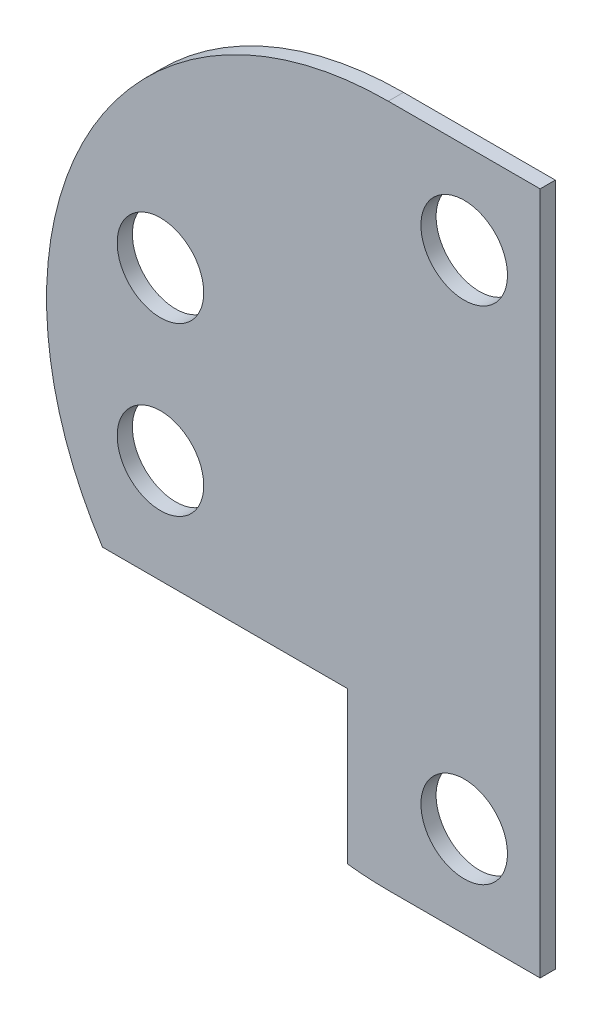
ISO-10303-21;
HEADER;
FILE_DESCRIPTION(('STEP AP214'),'2;1');
FILE_NAME('part.step','',(''),(''),'','','');
FILE_SCHEMA(('AUTOMOTIVE_DESIGN { 1 0 10303 214 1 1 1 1 }'));
ENDSEC;
DATA;
#1=APPLICATION_CONTEXT('core data for automotive mechanical design processes');
#2=APPLICATION_PROTOCOL_DEFINITION('international standard','automotive_design',2000,#1);
#3=PRODUCT_CONTEXT('',#1,'mechanical');
#4=PRODUCT('Part','Part','',(#3));
#5=PRODUCT_RELATED_PRODUCT_CATEGORY('part','',(#4));
#6=PRODUCT_DEFINITION_FORMATION('','',#4);
#7=PRODUCT_DEFINITION_CONTEXT('part definition',#1,'design');
#8=PRODUCT_DEFINITION('design','',#6,#7);
#9=PRODUCT_DEFINITION_SHAPE('','',#8);
#10=(LENGTH_UNIT() NAMED_UNIT(*) SI_UNIT(.MILLI.,.METRE.));
#11=(NAMED_UNIT(*) PLANE_ANGLE_UNIT() SI_UNIT($,.RADIAN.));
#12=(NAMED_UNIT(*) SI_UNIT($,.STERADIAN.) SOLID_ANGLE_UNIT());
#13=UNCERTAINTY_MEASURE_WITH_UNIT(LENGTH_MEASURE(1.E-05),#10,'distance_accuracy_value','');
#14=(GEOMETRIC_REPRESENTATION_CONTEXT(3) GLOBAL_UNCERTAINTY_ASSIGNED_CONTEXT((#13)) GLOBAL_UNIT_ASSIGNED_CONTEXT((#10,
#11,#12)) REPRESENTATION_CONTEXT('',''));
#15=CARTESIAN_POINT('',(0.,0.,0.));
#16=DIRECTION('',(0.,0.,1.));
#17=DIRECTION('',(1.,0.,0.));
#18=AXIS2_PLACEMENT_3D('',#15,#16,#17);
#19=CARTESIAN_POINT('',(-5.,0.,1.));
#20=DIRECTION('',(0.,0.,-1.));
#21=DIRECTION('',(-1.,0.,0.));
#22=AXIS2_PLACEMENT_3D('',#19,#20,#21);
#23=CYLINDRICAL_SURFACE('',#22,22.5);
#24=DIRECTION('',(0.,0.,-1.));
#25=VECTOR('',#24,1.);
#26=CARTESIAN_POINT('',(-23.8142073976025,-12.34,1.));
#27=LINE('',#26,#25);
#28=CARTESIAN_POINT('',(-23.8142073976025,-12.34,1.));
#29=VERTEX_POINT('',#28);
#30=CARTESIAN_POINT('',(-23.8142073976025,-12.34,0.));
#31=VERTEX_POINT('',#30);
#32=EDGE_CURVE('E113',#29,#31,#27,.T.);
#33=ORIENTED_EDGE('',*,*,#32,.F.);
#34=CARTESIAN_POINT('',(-5.,0.,1.));
#35=DIRECTION('',(0.,0.,1.));
#36=DIRECTION('',(-1.,0.,0.));
#37=AXIS2_PLACEMENT_3D('',#34,#35,#36);
#38=CIRCLE('',#37,22.5);
#39=CARTESIAN_POINT('',(-5.,22.5,1.));
#40=VERTEX_POINT('',#39);
#41=EDGE_CURVE('E124',#40,#29,#38,.T.);
#42=ORIENTED_EDGE('',*,*,#41,.F.);
#43=DIRECTION('',(0.,0.,-1.));
#44=VECTOR('',#43,1.);
#45=CARTESIAN_POINT('',(-5.,22.5,1.));
#46=LINE('',#45,#44);
#47=CARTESIAN_POINT('',(-5.,22.5,0.));
#48=VERTEX_POINT('',#47);
#49=EDGE_CURVE('E44',#40,#48,#46,.T.);
#50=ORIENTED_EDGE('',*,*,#49,.T.);
#51=CARTESIAN_POINT('',(-5.,0.,0.));
#52=DIRECTION('',(0.,0.,1.));
#53=DIRECTION('',(-1.,0.,0.));
#54=AXIS2_PLACEMENT_3D('',#51,#52,#53);
#55=CIRCLE('',#54,22.5);
#56=EDGE_CURVE('E139',#48,#31,#55,.T.);
#57=ORIENTED_EDGE('',*,*,#56,.T.);
#58=EDGE_LOOP('',(#33,#42,#50,#57));
#59=FACE_BOUND('',#58,.T.);
#60=ADVANCED_FACE('F36',(#59),#23,.T.);
#61=CARTESIAN_POINT('',(-5.,0.,1.));
#62=DIRECTION('',(0.,0.,-1.));
#63=DIRECTION('',(-1.,0.,0.));
#64=AXIS2_PLACEMENT_3D('',#61,#62,#63);
#65=PLANE('',#64);
#66=DIRECTION('',(-1.,0.,0.));
#67=VECTOR('',#66,1.);
#68=CARTESIAN_POINT('',(-7.7,-12.34,1.));
#69=LINE('',#68,#67);
#70=CARTESIAN_POINT('',(-7.7,-12.34,1.));
#71=VERTEX_POINT('',#70);
#72=EDGE_CURVE('E51',#71,#29,#69,.T.);
#73=ORIENTED_EDGE('',*,*,#72,.F.);
#74=DIRECTION('',(0.,-1.,0.));
#75=VECTOR('',#74,1.);
#76=CARTESIAN_POINT('',(-7.7,-12.34,1.));
#77=LINE('',#76,#75);
#78=CARTESIAN_POINT('',(-7.69999999999999,-22.3374125627835,1.));
#79=VERTEX_POINT('',#78);
#80=EDGE_CURVE('E107',#71,#79,#77,.T.);
#81=ORIENTED_EDGE('',*,*,#80,.T.);
#82=CARTESIAN_POINT('',(-5.,-22.5,1.));
#83=VERTEX_POINT('',#82);
#84=EDGE_CURVE('E117',#79,#83,#38,.T.);
#85=ORIENTED_EDGE('',*,*,#84,.T.);
#86=DIRECTION('',(1.,0.,0.));
#87=VECTOR('',#86,1.);
#88=CARTESIAN_POINT('',(-5.,-22.5,1.));
#89=LINE('',#88,#87);
#90=CARTESIAN_POINT('',(5.,-22.5,1.));
#91=VERTEX_POINT('',#90);
#92=EDGE_CURVE('E60',#83,#91,#89,.T.);
#93=ORIENTED_EDGE('',*,*,#92,.T.);
#94=DIRECTION('',(0.,1.,0.));
#95=VECTOR('',#94,1.);
#96=CARTESIAN_POINT('',(5.,-22.5,1.));
#97=LINE('',#96,#95);
#98=CARTESIAN_POINT('',(5.,22.5,1.));
#99=VERTEX_POINT('',#98);
#100=EDGE_CURVE('E126',#91,#99,#97,.T.);
#101=ORIENTED_EDGE('',*,*,#100,.T.);
#102=DIRECTION('',(-1.,0.,0.));
#103=VECTOR('',#102,1.);
#104=CARTESIAN_POINT('',(-5.,22.5,1.));
#105=LINE('',#104,#103);
#106=EDGE_CURVE('E88',#99,#40,#105,.T.);
#107=ORIENTED_EDGE('',*,*,#106,.T.);
#108=ORIENTED_EDGE('',*,*,#41,.T.);
#109=EDGE_LOOP('',(#73,#81,#85,#93,#101,#107,#108));
#110=FACE_BOUND('',#109,.T.);
#111=CARTESIAN_POINT('',(0.,16.5,1.));
#112=DIRECTION('',(0.,0.,1.));
#113=DIRECTION('',(1.,0.,0.));
#114=AXIS2_PLACEMENT_3D('',#111,#112,#113);
#115=CIRCLE('',#114,2.85);
#116=CARTESIAN_POINT('',(2.85,16.5,1.));
#117=VERTEX_POINT('',#116);
#118=EDGE_CURVE('E136',#117,#117,#115,.T.);
#119=ORIENTED_EDGE('',*,*,#118,.F.);
#120=EDGE_LOOP('',(#119));
#121=FACE_BOUND('',#120,.T.);
#122=CARTESIAN_POINT('',(0.,-16.5,1.));
#123=DIRECTION('',(0.,0.,1.));
#124=DIRECTION('',(1.,0.,0.));
#125=AXIS2_PLACEMENT_3D('',#122,#123,#124);
#126=CIRCLE('',#125,2.85);
#127=CARTESIAN_POINT('',(2.85,-16.5,1.));
#128=VERTEX_POINT('',#127);
#129=EDGE_CURVE('E174',#128,#128,#126,.T.);
#130=ORIENTED_EDGE('',*,*,#129,.F.);
#131=EDGE_LOOP('',(#130));
#132=FACE_BOUND('',#131,.T.);
#133=CARTESIAN_POINT('',(-20.,-5.5,1.));
#134=DIRECTION('',(0.,0.,1.));
#135=DIRECTION('',(1.,0.,0.));
#136=AXIS2_PLACEMENT_3D('',#133,#134,#135);
#137=CIRCLE('',#136,2.85);
#138=CARTESIAN_POINT('',(-17.15,-5.5,1.));
#139=VERTEX_POINT('',#138);
#140=EDGE_CURVE('E168',#139,#139,#137,.T.);
#141=ORIENTED_EDGE('',*,*,#140,.F.);
#142=EDGE_LOOP('',(#141));
#143=FACE_BOUND('',#142,.T.);
#144=CARTESIAN_POINT('',(-20.,5.5,1.));
#145=DIRECTION('',(0.,0.,1.));
#146=DIRECTION('',(1.,0.,0.));
#147=AXIS2_PLACEMENT_3D('',#144,#145,#146);
#148=CIRCLE('',#147,2.85);
#149=CARTESIAN_POINT('',(-17.15,5.5,1.));
#150=VERTEX_POINT('',#149);
#151=EDGE_CURVE('E162',#150,#150,#148,.T.);
#152=ORIENTED_EDGE('',*,*,#151,.F.);
#153=EDGE_LOOP('',(#152));
#154=FACE_BOUND('',#153,.T.);
#155=ADVANCED_FACE('F115',(#110,#121,#132,#143,#154),#65,.F.);
#156=CARTESIAN_POINT('',(-5.,0.,0.));
#157=DIRECTION('',(0.,0.,-1.));
#158=DIRECTION('',(-1.,0.,0.));
#159=AXIS2_PLACEMENT_3D('',#156,#157,#158);
#160=PLANE('',#159);
#161=DIRECTION('',(0.,-1.,0.));
#162=VECTOR('',#161,1.);
#163=CARTESIAN_POINT('',(-7.7,-12.34,0.));
#164=LINE('',#163,#162);
#165=CARTESIAN_POINT('',(-7.7,-12.34,0.));
#166=VERTEX_POINT('',#165);
#167=CARTESIAN_POINT('',(-7.69999999999999,-22.3374125627835,0.));
#168=VERTEX_POINT('',#167);
#169=EDGE_CURVE('E109',#166,#168,#164,.T.);
#170=ORIENTED_EDGE('',*,*,#169,.F.);
#171=DIRECTION('',(-1.,0.,0.));
#172=VECTOR('',#171,1.);
#173=CARTESIAN_POINT('',(-7.7,-12.34,0.));
#174=LINE('',#173,#172);
#175=EDGE_CURVE('E120',#166,#31,#174,.T.);
#176=ORIENTED_EDGE('',*,*,#175,.T.);
#177=ORIENTED_EDGE('',*,*,#56,.F.);
#178=DIRECTION('',(-1.,0.,0.));
#179=VECTOR('',#178,1.);
#180=CARTESIAN_POINT('',(-5.,22.5,0.));
#181=LINE('',#180,#179);
#182=CARTESIAN_POINT('',(5.,22.5,0.));
#183=VERTEX_POINT('',#182);
#184=EDGE_CURVE('E135',#183,#48,#181,.T.);
#185=ORIENTED_EDGE('',*,*,#184,.F.);
#186=DIRECTION('',(0.,1.,0.));
#187=VECTOR('',#186,1.);
#188=CARTESIAN_POINT('',(5.,-22.5,0.));
#189=LINE('',#188,#187);
#190=CARTESIAN_POINT('',(5.,-22.5,0.));
#191=VERTEX_POINT('',#190);
#192=EDGE_CURVE('E132',#191,#183,#189,.T.);
#193=ORIENTED_EDGE('',*,*,#192,.F.);
#194=DIRECTION('',(1.,0.,0.));
#195=VECTOR('',#194,1.);
#196=CARTESIAN_POINT('',(-5.,-22.5,0.));
#197=LINE('',#196,#195);
#198=CARTESIAN_POINT('',(-5.,-22.5,0.));
#199=VERTEX_POINT('',#198);
#200=EDGE_CURVE('E81',#199,#191,#197,.T.);
#201=ORIENTED_EDGE('',*,*,#200,.F.);
#202=EDGE_CURVE('E138',#168,#199,#55,.T.);
#203=ORIENTED_EDGE('',*,*,#202,.F.);
#204=EDGE_LOOP('',(#170,#176,#177,#185,#193,#201,#203));
#205=FACE_BOUND('',#204,.T.);
#206=CARTESIAN_POINT('',(-20.,-5.5,0.));
#207=DIRECTION('',(0.,0.,1.));
#208=DIRECTION('',(1.,0.,0.));
#209=AXIS2_PLACEMENT_3D('',#206,#207,#208);
#210=CIRCLE('',#209,2.85);
#211=CARTESIAN_POINT('',(-17.15,-5.5,0.));
#212=VERTEX_POINT('',#211);
#213=EDGE_CURVE('E165',#212,#212,#210,.T.);
#214=ORIENTED_EDGE('',*,*,#213,.T.);
#215=EDGE_LOOP('',(#214));
#216=FACE_BOUND('',#215,.T.);
#217=CARTESIAN_POINT('',(0.,16.5,0.));
#218=DIRECTION('',(0.,0.,1.));
#219=DIRECTION('',(1.,0.,0.));
#220=AXIS2_PLACEMENT_3D('',#217,#218,#219);
#221=CIRCLE('',#220,2.85);
#222=CARTESIAN_POINT('',(2.85,16.5,0.));
#223=VERTEX_POINT('',#222);
#224=EDGE_CURVE('E177',#223,#223,#221,.T.);
#225=ORIENTED_EDGE('',*,*,#224,.T.);
#226=EDGE_LOOP('',(#225));
#227=FACE_BOUND('',#226,.T.);
#228=CARTESIAN_POINT('',(0.,-16.5,0.));
#229=DIRECTION('',(0.,0.,1.));
#230=DIRECTION('',(1.,0.,0.));
#231=AXIS2_PLACEMENT_3D('',#228,#229,#230);
#232=CIRCLE('',#231,2.85);
#233=CARTESIAN_POINT('',(2.85,-16.5,0.));
#234=VERTEX_POINT('',#233);
#235=EDGE_CURVE('E171',#234,#234,#232,.T.);
#236=ORIENTED_EDGE('',*,*,#235,.T.);
#237=EDGE_LOOP('',(#236));
#238=FACE_BOUND('',#237,.T.);
#239=CARTESIAN_POINT('',(-20.,5.5,0.));
#240=DIRECTION('',(0.,0.,1.));
#241=DIRECTION('',(1.,0.,0.));
#242=AXIS2_PLACEMENT_3D('',#239,#240,#241);
#243=CIRCLE('',#242,2.85);
#244=CARTESIAN_POINT('',(-17.15,5.5,0.));
#245=VERTEX_POINT('',#244);
#246=EDGE_CURVE('E160',#245,#245,#243,.T.);
#247=ORIENTED_EDGE('',*,*,#246,.T.);
#248=EDGE_LOOP('',(#247));
#249=FACE_BOUND('',#248,.T.);
#250=ADVANCED_FACE('F150',(#205,#216,#227,#238,#249),#160,.T.);
#251=CARTESIAN_POINT('',(5.,-22.5,1.));
#252=DIRECTION('',(-1.,0.,0.));
#253=DIRECTION('',(0.,-1.,0.));
#254=AXIS2_PLACEMENT_3D('',#251,#252,#253);
#255=PLANE('',#254);
#256=ORIENTED_EDGE('',*,*,#192,.T.);
#257=DIRECTION('',(0.,0.,-1.));
#258=VECTOR('',#257,1.);
#259=CARTESIAN_POINT('',(5.,22.5,1.));
#260=LINE('',#259,#258);
#261=EDGE_CURVE('E11',#99,#183,#260,.T.);
#262=ORIENTED_EDGE('',*,*,#261,.F.);
#263=ORIENTED_EDGE('',*,*,#100,.F.);
#264=DIRECTION('',(0.,0.,-1.));
#265=VECTOR('',#264,1.);
#266=CARTESIAN_POINT('',(5.,-22.5,1.));
#267=LINE('',#266,#265);
#268=EDGE_CURVE('E131',#91,#191,#267,.T.);
#269=ORIENTED_EDGE('',*,*,#268,.T.);
#270=EDGE_LOOP('',(#256,#262,#263,#269));
#271=FACE_BOUND('',#270,.T.);
#272=ADVANCED_FACE('F38',(#271),#255,.F.);
#273=CARTESIAN_POINT('',(-5.,22.5,1.));
#274=DIRECTION('',(0.,-1.,0.));
#275=DIRECTION('',(0.,0.,-1.));
#276=AXIS2_PLACEMENT_3D('',#273,#274,#275);
#277=PLANE('',#276);
#278=ORIENTED_EDGE('',*,*,#184,.T.);
#279=ORIENTED_EDGE('',*,*,#49,.F.);
#280=ORIENTED_EDGE('',*,*,#106,.F.);
#281=ORIENTED_EDGE('',*,*,#261,.T.);
#282=EDGE_LOOP('',(#278,#279,#280,#281));
#283=FACE_BOUND('',#282,.T.);
#284=ADVANCED_FACE('F186',(#283),#277,.F.);
#285=ORIENTED_EDGE('',*,*,#84,.F.);
#286=DIRECTION('',(0.,0.,-1.));
#287=VECTOR('',#286,1.);
#288=CARTESIAN_POINT('',(-7.69999999999999,-22.3374125627835,1.));
#289=LINE('',#288,#287);
#290=EDGE_CURVE('E104',#79,#168,#289,.T.);
#291=ORIENTED_EDGE('',*,*,#290,.T.);
#292=ORIENTED_EDGE('',*,*,#202,.T.);
#293=DIRECTION('',(0.,0.,-1.));
#294=VECTOR('',#293,1.);
#295=CARTESIAN_POINT('',(-5.,-22.5,1.));
#296=LINE('',#295,#294);
#297=EDGE_CURVE('E123',#83,#199,#296,.T.);
#298=ORIENTED_EDGE('',*,*,#297,.F.);
#299=EDGE_LOOP('',(#285,#291,#292,#298));
#300=FACE_BOUND('',#299,.T.);
#301=ADVANCED_FACE('F122',(#300),#23,.T.);
#302=CARTESIAN_POINT('',(-5.,-22.5,1.));
#303=DIRECTION('',(0.,1.,0.));
#304=DIRECTION('',(0.,0.,1.));
#305=AXIS2_PLACEMENT_3D('',#302,#303,#304);
#306=PLANE('',#305);
#307=ORIENTED_EDGE('',*,*,#200,.T.);
#308=ORIENTED_EDGE('',*,*,#268,.F.);
#309=ORIENTED_EDGE('',*,*,#92,.F.);
#310=ORIENTED_EDGE('',*,*,#297,.T.);
#311=EDGE_LOOP('',(#307,#308,#309,#310));
#312=FACE_BOUND('',#311,.T.);
#313=ADVANCED_FACE('F192',(#312),#306,.F.);
#314=CARTESIAN_POINT('',(0.,16.5,1.));
#315=DIRECTION('',(0.,0.,-1.));
#316=DIRECTION('',(-1.,0.,0.));
#317=AXIS2_PLACEMENT_3D('',#314,#315,#316);
#318=CYLINDRICAL_SURFACE('',#317,2.85);
#319=ORIENTED_EDGE('',*,*,#118,.T.);
#320=EDGE_LOOP('',(#319));
#321=FACE_BOUND('',#320,.T.);
#322=ORIENTED_EDGE('',*,*,#224,.F.);
#323=EDGE_LOOP('',(#322));
#324=FACE_BOUND('',#323,.T.);
#325=ADVANCED_FACE('F202',(#321,#324),#318,.F.);
#326=CARTESIAN_POINT('',(0.,-16.5,1.));
#327=DIRECTION('',(0.,0.,-1.));
#328=DIRECTION('',(-1.,0.,0.));
#329=AXIS2_PLACEMENT_3D('',#326,#327,#328);
#330=CYLINDRICAL_SURFACE('',#329,2.85);
#331=ORIENTED_EDGE('',*,*,#129,.T.);
#332=EDGE_LOOP('',(#331));
#333=FACE_BOUND('',#332,.T.);
#334=ORIENTED_EDGE('',*,*,#235,.F.);
#335=EDGE_LOOP('',(#334));
#336=FACE_BOUND('',#335,.T.);
#337=ADVANCED_FACE('F207',(#333,#336),#330,.F.);
#338=CARTESIAN_POINT('',(-20.,-5.5,1.));
#339=DIRECTION('',(0.,0.,-1.));
#340=DIRECTION('',(-1.,0.,0.));
#341=AXIS2_PLACEMENT_3D('',#338,#339,#340);
#342=CYLINDRICAL_SURFACE('',#341,2.85);
#343=ORIENTED_EDGE('',*,*,#140,.T.);
#344=EDGE_LOOP('',(#343));
#345=FACE_BOUND('',#344,.T.);
#346=ORIENTED_EDGE('',*,*,#213,.F.);
#347=EDGE_LOOP('',(#346));
#348=FACE_BOUND('',#347,.T.);
#349=ADVANCED_FACE('F211',(#345,#348),#342,.F.);
#350=CARTESIAN_POINT('',(-20.,5.5,1.));
#351=DIRECTION('',(0.,0.,-1.));
#352=DIRECTION('',(-1.,0.,0.));
#353=AXIS2_PLACEMENT_3D('',#350,#351,#352);
#354=CYLINDRICAL_SURFACE('',#353,2.85);
#355=ORIENTED_EDGE('',*,*,#151,.T.);
#356=EDGE_LOOP('',(#355));
#357=FACE_BOUND('',#356,.T.);
#358=ORIENTED_EDGE('',*,*,#246,.F.);
#359=EDGE_LOOP('',(#358));
#360=FACE_BOUND('',#359,.T.);
#361=ADVANCED_FACE('F215',(#357,#360),#354,.F.);
#362=CARTESIAN_POINT('',(-7.7,-12.34,1.));
#363=DIRECTION('',(1.,0.,0.));
#364=DIRECTION('',(0.,1.,0.));
#365=AXIS2_PLACEMENT_3D('',#362,#363,#364);
#366=PLANE('',#365);
#367=ORIENTED_EDGE('',*,*,#169,.T.);
#368=ORIENTED_EDGE('',*,*,#290,.F.);
#369=ORIENTED_EDGE('',*,*,#80,.F.);
#370=DIRECTION('',(0.,0.,-1.));
#371=VECTOR('',#370,1.);
#372=CARTESIAN_POINT('',(-7.7,-12.34,1.));
#373=LINE('',#372,#371);
#374=EDGE_CURVE('E158',#71,#166,#373,.T.);
#375=ORIENTED_EDGE('',*,*,#374,.T.);
#376=EDGE_LOOP('',(#367,#368,#369,#375));
#377=FACE_BOUND('',#376,.T.);
#378=ADVANCED_FACE('F106',(#377),#366,.F.);
#379=CARTESIAN_POINT('',(-7.7,-12.34,1.));
#380=DIRECTION('',(0.,-1.,0.));
#381=DIRECTION('',(0.,0.,-1.));
#382=AXIS2_PLACEMENT_3D('',#379,#380,#381);
#383=PLANE('',#382);
#384=ORIENTED_EDGE('',*,*,#175,.F.);
#385=ORIENTED_EDGE('',*,*,#374,.F.);
#386=ORIENTED_EDGE('',*,*,#72,.T.);
#387=ORIENTED_EDGE('',*,*,#32,.T.);
#388=EDGE_LOOP('',(#384,#385,#386,#387));
#389=FACE_BOUND('',#388,.T.);
#390=ADVANCED_FACE('F222',(#389),#383,.T.);
#391=CLOSED_SHELL('',(#60,#155,#250,#272,#284,#301,#313,#325,#337,#349,#361,#378,#390));
#392=MANIFOLD_SOLID_BREP('B2',#391);
#393=ADVANCED_BREP_SHAPE_REPRESENTATION('',(#18,#392),#14);
#394=SHAPE_DEFINITION_REPRESENTATION(#9,#393);
ENDSEC;
END-ISO-10303-21;
